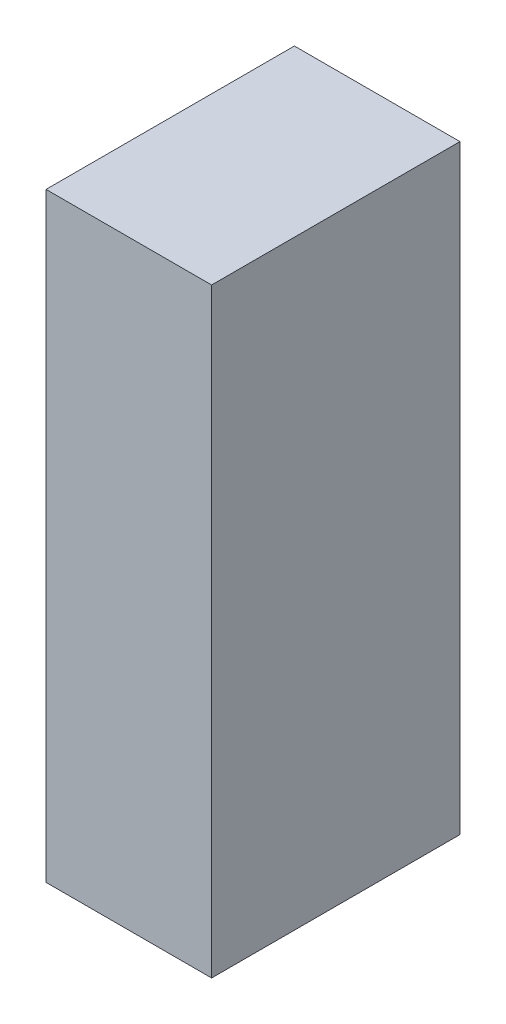
ISO-10303-21;
HEADER;
FILE_DESCRIPTION(('STEP AP214'),'2;1');
FILE_NAME('part.step','',(''),(''),'','','');
FILE_SCHEMA(('AUTOMOTIVE_DESIGN { 1 0 10303 214 1 1 1 1 }'));
ENDSEC;
DATA;
#1=APPLICATION_CONTEXT('core data for automotive mechanical design processes');
#2=APPLICATION_PROTOCOL_DEFINITION('international standard','automotive_design',2000,#1);
#3=PRODUCT_CONTEXT('',#1,'mechanical');
#4=PRODUCT('Part','Part','',(#3));
#5=PRODUCT_RELATED_PRODUCT_CATEGORY('part','',(#4));
#6=PRODUCT_DEFINITION_FORMATION('','',#4);
#7=PRODUCT_DEFINITION_CONTEXT('part definition',#1,'design');
#8=PRODUCT_DEFINITION('design','',#6,#7);
#9=PRODUCT_DEFINITION_SHAPE('','',#8);
#10=(LENGTH_UNIT() NAMED_UNIT(*) SI_UNIT(.MILLI.,.METRE.));
#11=(NAMED_UNIT(*) PLANE_ANGLE_UNIT() SI_UNIT($,.RADIAN.));
#12=(NAMED_UNIT(*) SI_UNIT($,.STERADIAN.) SOLID_ANGLE_UNIT());
#13=UNCERTAINTY_MEASURE_WITH_UNIT(LENGTH_MEASURE(1.E-05),#10,'distance_accuracy_value','');
#14=(GEOMETRIC_REPRESENTATION_CONTEXT(3) GLOBAL_UNCERTAINTY_ASSIGNED_CONTEXT((#13)) GLOBAL_UNIT_ASSIGNED_CONTEXT((#10,
#11,#12)) REPRESENTATION_CONTEXT('',''));
#15=CARTESIAN_POINT('',(0.,0.,0.));
#16=DIRECTION('',(0.,0.,1.));
#17=DIRECTION('',(1.,0.,0.));
#18=AXIS2_PLACEMENT_3D('',#15,#16,#17);
#19=CARTESIAN_POINT('',(0.700001885251936,0.725001889737712,0.));
#20=DIRECTION('',(-1.,4.37113882867379E-08,0.));
#21=DIRECTION('',(-4.37113882867379E-08,-1.,0.));
#22=AXIS2_PLACEMENT_3D('',#19,#20,#21);
#23=PLANE('',#22);
#24=DIRECTION('',(-4.37113882930187E-08,-0.999999999999999,0.));
#25=VECTOR('',#24,1.);
#26=CARTESIAN_POINT('',(0.700001885251936,0.725001889737712,0.));
#27=LINE('',#26,#25);
#28=CARTESIAN_POINT('',(0.700001885251936,0.725001889737712,0.));
#29=VERTEX_POINT('',#28);
#30=CARTESIAN_POINT('',(0.70000182186989,-0.725010317293538,0.));
#31=VERTEX_POINT('',#30);
#32=EDGE_CURVE('E11',#29,#31,#27,.T.);
#33=ORIENTED_EDGE('',*,*,#32,.T.);
#34=DIRECTION('',(0.,0.,1.));
#35=VECTOR('',#34,1.);
#36=CARTESIAN_POINT('',(0.700001821869889,-0.725010317293538,0.));
#37=LINE('',#36,#35);
#38=CARTESIAN_POINT('',(0.70000182186989,-0.725010317293538,0.599998772144318));
#39=VERTEX_POINT('',#38);
#40=EDGE_CURVE('E88',#31,#39,#37,.T.);
#41=ORIENTED_EDGE('',*,*,#40,.T.);
#42=DIRECTION('',(-4.37113882930187E-08,-0.999999999999999,0.));
#43=VECTOR('',#42,1.);
#44=CARTESIAN_POINT('',(0.700001885251936,0.725001889737712,0.599998772144318));
#45=LINE('',#44,#43);
#46=CARTESIAN_POINT('',(0.700001885251936,0.725001889737712,0.599998772144318));
#47=VERTEX_POINT('',#46);
#48=EDGE_CURVE('E83',#47,#39,#45,.T.);
#49=ORIENTED_EDGE('',*,*,#48,.F.);
#50=DIRECTION('',(0.,0.,1.));
#51=VECTOR('',#50,1.);
#52=CARTESIAN_POINT('',(0.700001885251936,0.725001889737753,0.));
#53=LINE('',#52,#51);
#54=EDGE_CURVE('E72',#29,#47,#53,.T.);
#55=ORIENTED_EDGE('',*,*,#54,.F.);
#56=EDGE_LOOP('',(#33,#41,#49,#55));
#57=FACE_BOUND('',#56,.T.);
#58=ADVANCED_FACE('F17',(#57),#23,.T.);
#59=CARTESIAN_POINT('',(0.70000182186989,-0.725010317293538,0.));
#60=DIRECTION('',(-4.37113882867379E-08,-1.,0.));
#61=DIRECTION('',(1.,-4.37113882867379E-08,0.));
#62=AXIS2_PLACEMENT_3D('',#59,#60,#61);
#63=PLANE('',#62);
#64=DIRECTION('',(0.999999999999999,-4.37113881855009E-08,0.));
#65=VECTOR('',#64,1.);
#66=CARTESIAN_POINT('',(0.70000182186989,-0.725010317293538,0.));
#67=LINE('',#66,#65);
#68=CARTESIAN_POINT('',(1.1000033477488,-0.725010334778119,0.));
#69=VERTEX_POINT('',#68);
#70=EDGE_CURVE('E24',#31,#69,#67,.T.);
#71=ORIENTED_EDGE('',*,*,#70,.T.);
#72=DIRECTION('',(0.,0.,1.));
#73=VECTOR('',#72,1.);
#74=CARTESIAN_POINT('',(1.1000033477488,-0.72501033477816,0.));
#75=LINE('',#74,#73);
#76=CARTESIAN_POINT('',(1.1000033477488,-0.725010334778119,0.599998772144318));
#77=VERTEX_POINT('',#76);
#78=EDGE_CURVE('E85',#69,#77,#75,.T.);
#79=ORIENTED_EDGE('',*,*,#78,.T.);
#80=DIRECTION('',(0.999999999999999,-4.37113881855009E-08,0.));
#81=VECTOR('',#80,1.);
#82=CARTESIAN_POINT('',(0.70000182186989,-0.725010317293538,0.599998772144318));
#83=LINE('',#82,#81);
#84=EDGE_CURVE('E66',#39,#77,#83,.T.);
#85=ORIENTED_EDGE('',*,*,#84,.F.);
#86=ORIENTED_EDGE('',*,*,#40,.F.);
#87=EDGE_LOOP('',(#71,#79,#85,#86));
#88=FACE_BOUND('',#87,.T.);
#89=ADVANCED_FACE('F89',(#88),#63,.T.);
#90=CARTESIAN_POINT('',(1.1000033477488,-0.725010334778119,0.));
#91=DIRECTION('',(1.,-4.37113882867379E-08,0.));
#92=DIRECTION('',(4.37113882867379E-08,1.,0.));
#93=AXIS2_PLACEMENT_3D('',#90,#91,#92);
#94=PLANE('',#93);
#95=DIRECTION('',(4.37113882164523E-08,0.999999999999999,0.));
#96=VECTOR('',#95,1.);
#97=CARTESIAN_POINT('',(1.1000033477488,-0.725010334778119,0.));
#98=LINE('',#97,#96);
#99=CARTESIAN_POINT('',(1.10000341113084,0.725001872253131,0.));
#100=VERTEX_POINT('',#99);
#101=EDGE_CURVE('E62',#69,#100,#98,.T.);
#102=ORIENTED_EDGE('',*,*,#101,.T.);
#103=DIRECTION('',(0.,0.,1.));
#104=VECTOR('',#103,1.);
#105=CARTESIAN_POINT('',(1.10000341113084,0.725001872253131,0.));
#106=LINE('',#105,#104);
#107=CARTESIAN_POINT('',(1.10000341113084,0.725001872253131,0.599998772144318));
#108=VERTEX_POINT('',#107);
#109=EDGE_CURVE('E55',#100,#108,#106,.T.);
#110=ORIENTED_EDGE('',*,*,#109,.T.);
#111=DIRECTION('',(4.37113882164523E-08,0.999999999999999,0.));
#112=VECTOR('',#111,1.);
#113=CARTESIAN_POINT('',(1.1000033477488,-0.725010334778119,0.599998772144318));
#114=LINE('',#113,#112);
#115=EDGE_CURVE('E59',#77,#108,#114,.T.);
#116=ORIENTED_EDGE('',*,*,#115,.F.);
#117=ORIENTED_EDGE('',*,*,#78,.F.);
#118=EDGE_LOOP('',(#102,#110,#116,#117));
#119=FACE_BOUND('',#118,.T.);
#120=ADVANCED_FACE('F57',(#119),#94,.T.);
#121=CARTESIAN_POINT('',(1.10000341113084,0.725001872253131,0.));
#122=DIRECTION('',(4.37113882867379E-08,1.,0.));
#123=DIRECTION('',(-1.,4.37113882867379E-08,0.));
#124=AXIS2_PLACEMENT_3D('',#121,#122,#123);
#125=PLANE('',#124);
#126=DIRECTION('',(-0.999999999999999,4.37113881855009E-08,0.));
#127=VECTOR('',#126,1.);
#128=CARTESIAN_POINT('',(1.10000341113084,0.725001872253131,0.));
#129=LINE('',#128,#127);
#130=EDGE_CURVE('E65',#100,#29,#129,.T.);
#131=ORIENTED_EDGE('',*,*,#130,.T.);
#132=ORIENTED_EDGE('',*,*,#54,.T.);
#133=DIRECTION('',(-0.999999999999999,4.37113881855009E-08,0.));
#134=VECTOR('',#133,1.);
#135=CARTESIAN_POINT('',(1.10000341113084,0.725001872253131,0.599998772144318));
#136=LINE('',#135,#134);
#137=EDGE_CURVE('E70',#108,#47,#136,.T.);
#138=ORIENTED_EDGE('',*,*,#137,.F.);
#139=ORIENTED_EDGE('',*,*,#109,.F.);
#140=EDGE_LOOP('',(#131,#132,#138,#139));
#141=FACE_BOUND('',#140,.T.);
#142=ADVANCED_FACE('F71',(#141),#125,.T.);
#143=CARTESIAN_POINT('',(-95.6999816894531,411.399993896484,0.599998772144318));
#144=DIRECTION('',(0.,0.,1.));
#145=DIRECTION('',(-4.37113882867379E-08,-1.,0.));
#146=AXIS2_PLACEMENT_3D('',#143,#144,#145);
#147=PLANE('',#146);
#148=ORIENTED_EDGE('',*,*,#48,.T.);
#149=ORIENTED_EDGE('',*,*,#84,.T.);
#150=ORIENTED_EDGE('',*,*,#115,.T.);
#151=ORIENTED_EDGE('',*,*,#137,.T.);
#152=EDGE_LOOP('',(#148,#149,#150,#151));
#153=FACE_BOUND('',#152,.T.);
#154=ADVANCED_FACE('F76',(#153),#147,.T.);
#155=CARTESIAN_POINT('',(-95.6999816894531,411.399993896484,0.));
#156=DIRECTION('',(0.,0.,1.));
#157=DIRECTION('',(-4.37113882867379E-08,-1.,0.));
#158=AXIS2_PLACEMENT_3D('',#155,#156,#157);
#159=PLANE('',#158);
#160=ORIENTED_EDGE('',*,*,#130,.F.);
#161=ORIENTED_EDGE('',*,*,#101,.F.);
#162=ORIENTED_EDGE('',*,*,#70,.F.);
#163=ORIENTED_EDGE('',*,*,#32,.F.);
#164=EDGE_LOOP('',(#160,#161,#162,#163));
#165=FACE_BOUND('',#164,.T.);
#166=ADVANCED_FACE('F91',(#165),#159,.F.);
#167=CLOSED_SHELL('',(#58,#89,#120,#142,#154,#166));
#168=MANIFOLD_SOLID_BREP('B1',#167);
#169=ADVANCED_BREP_SHAPE_REPRESENTATION('',(#18,#168),#14);
#170=SHAPE_DEFINITION_REPRESENTATION(#9,#169);
ENDSEC;
END-ISO-10303-21;
